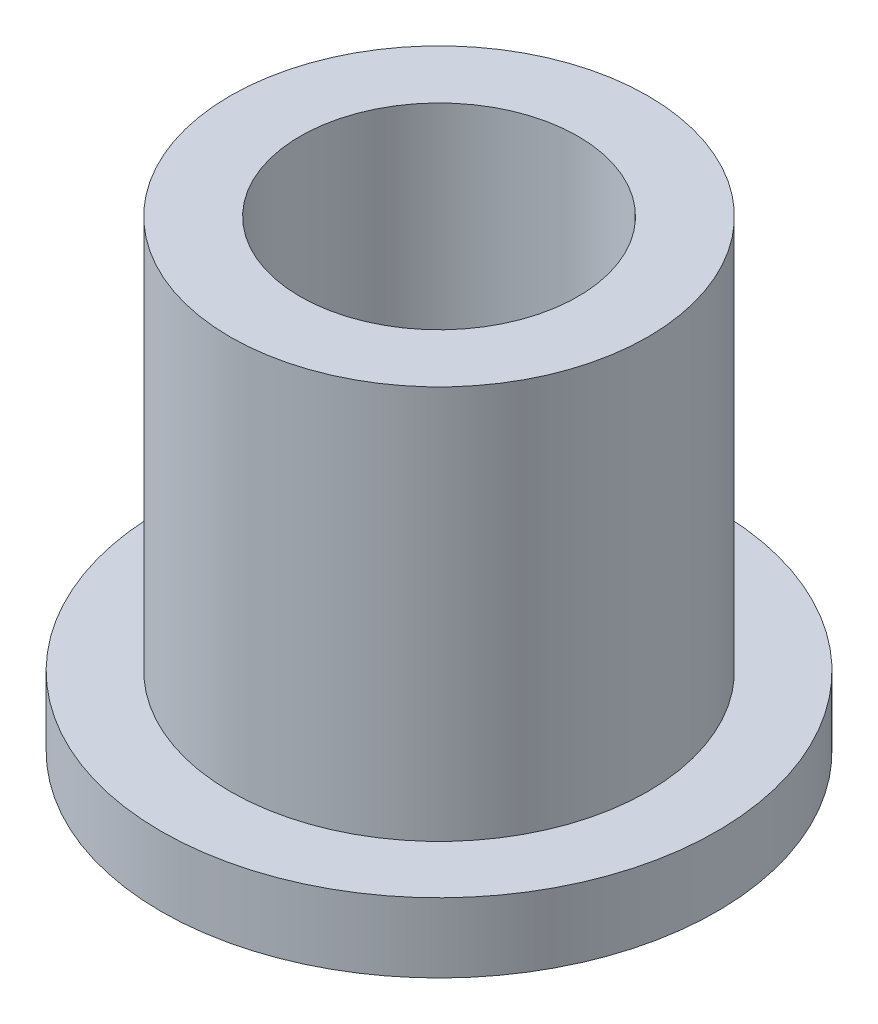
ISO-10303-21;
HEADER;
FILE_DESCRIPTION(('STEP AP214'),'2;1');
FILE_NAME('part.step','',(''),(''),'','','');
FILE_SCHEMA(('AUTOMOTIVE_DESIGN { 1 0 10303 214 1 1 1 1 }'));
ENDSEC;
DATA;
#1=APPLICATION_CONTEXT('core data for automotive mechanical design processes');
#2=APPLICATION_PROTOCOL_DEFINITION('international standard','automotive_design',2000,#1);
#3=PRODUCT_CONTEXT('',#1,'mechanical');
#4=PRODUCT('Part','Part','',(#3));
#5=PRODUCT_RELATED_PRODUCT_CATEGORY('part','',(#4));
#6=PRODUCT_DEFINITION_FORMATION('','',#4);
#7=PRODUCT_DEFINITION_CONTEXT('part definition',#1,'design');
#8=PRODUCT_DEFINITION('design','',#6,#7);
#9=PRODUCT_DEFINITION_SHAPE('','',#8);
#10=(LENGTH_UNIT() NAMED_UNIT(*) SI_UNIT(.MILLI.,.METRE.));
#11=(NAMED_UNIT(*) PLANE_ANGLE_UNIT() SI_UNIT($,.RADIAN.));
#12=(NAMED_UNIT(*) SI_UNIT($,.STERADIAN.) SOLID_ANGLE_UNIT());
#13=UNCERTAINTY_MEASURE_WITH_UNIT(LENGTH_MEASURE(1.E-05),#10,'distance_accuracy_value','');
#14=(GEOMETRIC_REPRESENTATION_CONTEXT(3) GLOBAL_UNCERTAINTY_ASSIGNED_CONTEXT((#13)) GLOBAL_UNIT_ASSIGNED_CONTEXT((#10,
#11,#12)) REPRESENTATION_CONTEXT('',''));
#15=CARTESIAN_POINT('',(0.,0.,0.));
#16=DIRECTION('',(0.,0.,1.));
#17=DIRECTION('',(1.,0.,0.));
#18=AXIS2_PLACEMENT_3D('',#15,#16,#17);
#19=CARTESIAN_POINT('',(0.,10.,0.));
#20=DIRECTION('',(0.,1.,0.));
#21=DIRECTION('',(0.,0.,1.));
#22=AXIS2_PLACEMENT_3D('',#19,#20,#21);
#23=PLANE('',#22);
#24=CARTESIAN_POINT('',(0.,10.,0.));
#25=DIRECTION('',(0.,1.,0.));
#26=DIRECTION('',(0.,0.,1.));
#27=AXIS2_PLACEMENT_3D('',#24,#25,#26);
#28=CIRCLE('',#27,4.51);
#29=CARTESIAN_POINT('',(0.,10.,4.51));
#30=VERTEX_POINT('',#29);
#31=EDGE_CURVE('E10',#30,#30,#28,.T.);
#32=ORIENTED_EDGE('',*,*,#31,.T.);
#33=EDGE_LOOP('',(#32));
#34=FACE_BOUND('',#33,.T.);
#35=CARTESIAN_POINT('',(0.,10.,0.));
#36=DIRECTION('',(0.,1.,0.));
#37=DIRECTION('',(0.,0.,1.));
#38=AXIS2_PLACEMENT_3D('',#35,#36,#37);
#39=CIRCLE('',#38,3.);
#40=CARTESIAN_POINT('',(0.,10.,3.));
#41=VERTEX_POINT('',#40);
#42=EDGE_CURVE('E40',#41,#41,#39,.T.);
#43=ORIENTED_EDGE('',*,*,#42,.F.);
#44=EDGE_LOOP('',(#43));
#45=FACE_BOUND('',#44,.T.);
#46=ADVANCED_FACE('F33',(#34,#45),#23,.T.);
#47=CARTESIAN_POINT('',(0.,0.,0.));
#48=DIRECTION('',(0.,1.,0.));
#49=DIRECTION('',(0.,0.,1.));
#50=AXIS2_PLACEMENT_3D('',#47,#48,#49);
#51=PLANE('',#50);
#52=CARTESIAN_POINT('',(0.,0.,0.));
#53=DIRECTION('',(0.,1.,0.));
#54=DIRECTION('',(0.,0.,1.));
#55=AXIS2_PLACEMENT_3D('',#52,#53,#54);
#56=CIRCLE('',#55,3.);
#57=CARTESIAN_POINT('',(0.,0.,3.));
#58=VERTEX_POINT('',#57);
#59=EDGE_CURVE('E44',#58,#58,#56,.T.);
#60=ORIENTED_EDGE('',*,*,#59,.T.);
#61=EDGE_LOOP('',(#60));
#62=FACE_BOUND('',#61,.T.);
#63=CARTESIAN_POINT('',(0.,0.,0.));
#64=DIRECTION('',(0.,1.,0.));
#65=DIRECTION('',(0.,0.,1.));
#66=AXIS2_PLACEMENT_3D('',#63,#64,#65);
#67=CIRCLE('',#66,6.);
#68=CARTESIAN_POINT('',(0.,0.,6.));
#69=VERTEX_POINT('',#68);
#70=EDGE_CURVE('E51',#69,#69,#67,.T.);
#71=ORIENTED_EDGE('',*,*,#70,.F.);
#72=EDGE_LOOP('',(#71));
#73=FACE_BOUND('',#72,.T.);
#74=ADVANCED_FACE('F76',(#62,#73),#51,.F.);
#75=CARTESIAN_POINT('',(0.,10.,0.));
#76=DIRECTION('',(0.,-1.,0.));
#77=DIRECTION('',(0.,0.,-1.));
#78=AXIS2_PLACEMENT_3D('',#75,#76,#77);
#79=CYLINDRICAL_SURFACE('',#78,4.51);
#80=CARTESIAN_POINT('',(0.,1.5,0.));
#81=DIRECTION('',(0.,1.,0.));
#82=DIRECTION('',(0.,0.,1.));
#83=AXIS2_PLACEMENT_3D('',#80,#81,#82);
#84=CIRCLE('',#83,4.51);
#85=CARTESIAN_POINT('',(0.,1.5,4.51));
#86=VERTEX_POINT('',#85);
#87=EDGE_CURVE('E54',#86,#86,#84,.T.);
#88=ORIENTED_EDGE('',*,*,#87,.T.);
#89=EDGE_LOOP('',(#88));
#90=FACE_BOUND('',#89,.T.);
#91=ORIENTED_EDGE('',*,*,#31,.F.);
#92=EDGE_LOOP('',(#91));
#93=FACE_BOUND('',#92,.T.);
#94=ADVANCED_FACE('F35',(#90,#93),#79,.T.);
#95=CARTESIAN_POINT('',(0.,10.,0.));
#96=DIRECTION('',(0.,-1.,0.));
#97=DIRECTION('',(0.,0.,-1.));
#98=AXIS2_PLACEMENT_3D('',#95,#96,#97);
#99=CYLINDRICAL_SURFACE('',#98,3.);
#100=ORIENTED_EDGE('',*,*,#42,.T.);
#101=EDGE_LOOP('',(#100));
#102=FACE_BOUND('',#101,.T.);
#103=ORIENTED_EDGE('',*,*,#59,.F.);
#104=EDGE_LOOP('',(#103));
#105=FACE_BOUND('',#104,.T.);
#106=ADVANCED_FACE('F65',(#102,#105),#99,.F.);
#107=CARTESIAN_POINT('',(0.,1.5,0.));
#108=DIRECTION('',(0.,1.,0.));
#109=DIRECTION('',(0.,0.,1.));
#110=AXIS2_PLACEMENT_3D('',#107,#108,#109);
#111=PLANE('',#110);
#112=CARTESIAN_POINT('',(0.,1.5,0.));
#113=DIRECTION('',(0.,1.,0.));
#114=DIRECTION('',(0.,0.,1.));
#115=AXIS2_PLACEMENT_3D('',#112,#113,#114);
#116=CIRCLE('',#115,6.);
#117=CARTESIAN_POINT('',(0.,1.5,6.));
#118=VERTEX_POINT('',#117);
#119=EDGE_CURVE('E49',#118,#118,#116,.T.);
#120=ORIENTED_EDGE('',*,*,#119,.T.);
#121=EDGE_LOOP('',(#120));
#122=FACE_BOUND('',#121,.T.);
#123=ORIENTED_EDGE('',*,*,#87,.F.);
#124=EDGE_LOOP('',(#123));
#125=FACE_BOUND('',#124,.T.);
#126=ADVANCED_FACE('F62',(#122,#125),#111,.T.);
#127=CARTESIAN_POINT('',(0.,1.5,0.));
#128=DIRECTION('',(0.,-1.,0.));
#129=DIRECTION('',(0.,0.,-1.));
#130=AXIS2_PLACEMENT_3D('',#127,#128,#129);
#131=CYLINDRICAL_SURFACE('',#130,6.);
#132=ORIENTED_EDGE('',*,*,#119,.F.);
#133=EDGE_LOOP('',(#132));
#134=FACE_BOUND('',#133,.T.);
#135=ORIENTED_EDGE('',*,*,#70,.T.);
#136=EDGE_LOOP('',(#135));
#137=FACE_BOUND('',#136,.T.);
#138=ADVANCED_FACE('F64',(#134,#137),#131,.T.);
#139=CLOSED_SHELL('',(#46,#74,#94,#106,#126,#138));
#140=MANIFOLD_SOLID_BREP('B2',#139);
#141=ADVANCED_BREP_SHAPE_REPRESENTATION('',(#18,#140),#14);
#142=SHAPE_DEFINITION_REPRESENTATION(#9,#141);
ENDSEC;
END-ISO-10303-21;
